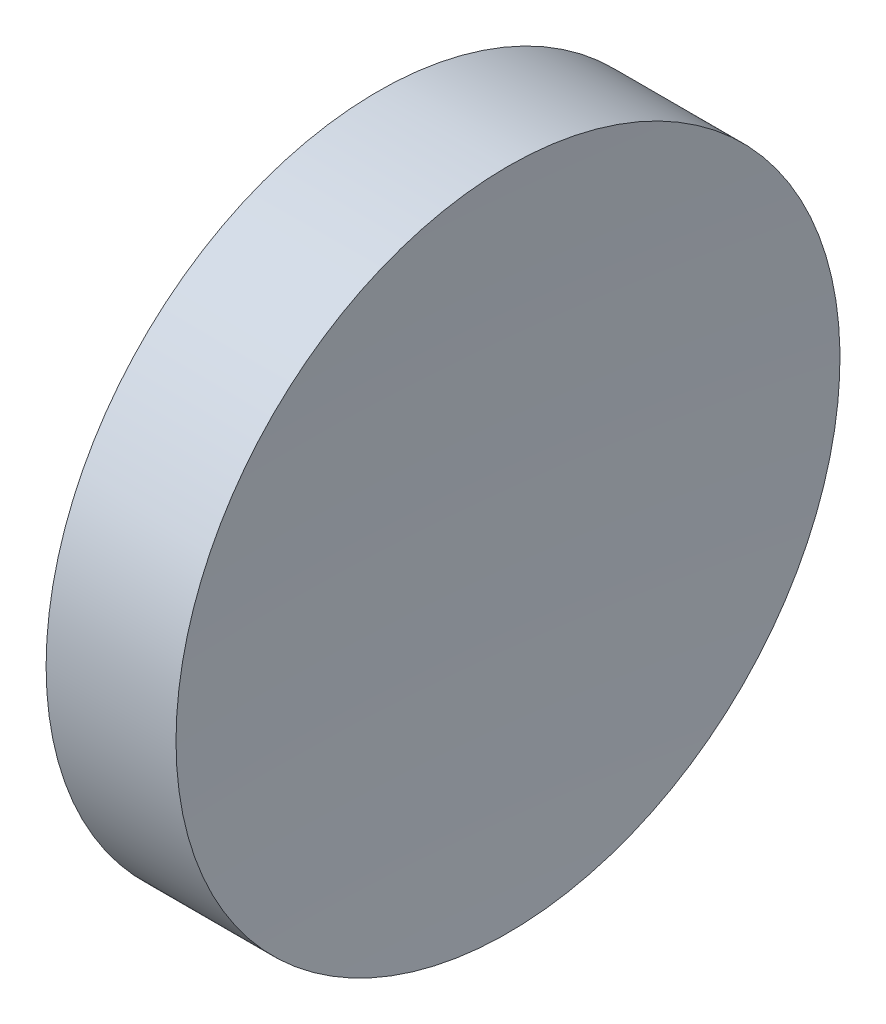
ISO-10303-21;
HEADER;
FILE_DESCRIPTION(('STEP AP214'),'2;1');
FILE_NAME('part.step','',(''),(''),'','','');
FILE_SCHEMA(('AUTOMOTIVE_DESIGN { 1 0 10303 214 1 1 1 1 }'));
ENDSEC;
DATA;
#1=APPLICATION_CONTEXT('core data for automotive mechanical design processes');
#2=APPLICATION_PROTOCOL_DEFINITION('international standard','automotive_design',2000,#1);
#3=PRODUCT_CONTEXT('',#1,'mechanical');
#4=PRODUCT('Part','Part','',(#3));
#5=PRODUCT_RELATED_PRODUCT_CATEGORY('part','',(#4));
#6=PRODUCT_DEFINITION_FORMATION('','',#4);
#7=PRODUCT_DEFINITION_CONTEXT('part definition',#1,'design');
#8=PRODUCT_DEFINITION('design','',#6,#7);
#9=PRODUCT_DEFINITION_SHAPE('','',#8);
#10=(LENGTH_UNIT() NAMED_UNIT(*) SI_UNIT(.MILLI.,.METRE.));
#11=(NAMED_UNIT(*) PLANE_ANGLE_UNIT() SI_UNIT($,.RADIAN.));
#12=(NAMED_UNIT(*) SI_UNIT($,.STERADIAN.) SOLID_ANGLE_UNIT());
#13=UNCERTAINTY_MEASURE_WITH_UNIT(LENGTH_MEASURE(1.E-05),#10,'distance_accuracy_value','');
#14=(GEOMETRIC_REPRESENTATION_CONTEXT(3) GLOBAL_UNCERTAINTY_ASSIGNED_CONTEXT((#13)) GLOBAL_UNIT_ASSIGNED_CONTEXT((#10,
#11,#12)) REPRESENTATION_CONTEXT('',''));
#15=CARTESIAN_POINT('',(0.,0.,0.));
#16=DIRECTION('',(0.,0.,1.));
#17=DIRECTION('',(1.,0.,0.));
#18=AXIS2_PLACEMENT_3D('',#15,#16,#17);
#19=CARTESIAN_POINT('',(639.185311066924,138.756042246744,0.));
#20=DIRECTION('',(-1.,0.,0.));
#21=DIRECTION('',(0.,1.,0.));
#22=AXIS2_PLACEMENT_3D('',#19,#20,#21);
#23=SPHERICAL_SURFACE('',#22,400.);
#24=CARTESIAN_POINT('',(239.967325500141,138.756042246745,0.));
#25=DIRECTION('',(-1.,0.,0.));
#26=DIRECTION('',(0.,0.,1.));
#27=AXIS2_PLACEMENT_3D('',#24,#25,#26);
#28=CIRCLE('',#27,25.);
#29=CARTESIAN_POINT('',(239.967325500141,138.756042246745,25.));
#30=VERTEX_POINT('',#29);
#31=EDGE_CURVE('E10',#30,#30,#28,.T.);
#32=ORIENTED_EDGE('',*,*,#31,.F.);
#33=EDGE_LOOP('',(#32));
#34=FACE_BOUND('',#33,.T.);
#35=ADVANCED_FACE('F35',(#34),#23,.F.);
#36=CARTESIAN_POINT('',(217.97028600433,138.756042246745,0.));
#37=DIRECTION('',(-1.,0.,0.));
#38=DIRECTION('',(0.,0.,1.));
#39=AXIS2_PLACEMENT_3D('',#36,#37,#38);
#40=CYLINDRICAL_SURFACE('',#39,25.);
#41=CARTESIAN_POINT('',(230.185311069839,138.756042246745,0.));
#42=DIRECTION('',(-1.,0.,0.));
#43=DIRECTION('',(0.,0.,1.));
#44=AXIS2_PLACEMENT_3D('',#41,#42,#43);
#45=CIRCLE('',#44,25.);
#46=CARTESIAN_POINT('',(230.185311069839,138.756042246745,25.));
#47=VERTEX_POINT('',#46);
#48=EDGE_CURVE('E41',#47,#47,#45,.T.);
#49=ORIENTED_EDGE('',*,*,#48,.F.);
#50=EDGE_LOOP('',(#49));
#51=FACE_BOUND('',#50,.T.);
#52=ORIENTED_EDGE('',*,*,#31,.T.);
#53=EDGE_LOOP('',(#52));
#54=FACE_BOUND('',#53,.T.);
#55=ADVANCED_FACE('F49',(#51,#54),#40,.T.);
#56=CARTESIAN_POINT('',(230.185311069839,138.756042246745,0.));
#57=DIRECTION('',(1.,0.,0.));
#58=DIRECTION('',(0.,0.,-1.));
#59=AXIS2_PLACEMENT_3D('',#56,#57,#58);
#60=PLANE('',#59);
#61=ORIENTED_EDGE('',*,*,#48,.T.);
#62=EDGE_LOOP('',(#61));
#63=FACE_BOUND('',#62,.T.);
#64=ADVANCED_FACE('F47',(#63),#60,.F.);
#65=CLOSED_SHELL('',(#35,#55,#64));
#66=MANIFOLD_SOLID_BREP('B2',#65);
#67=ADVANCED_BREP_SHAPE_REPRESENTATION('',(#18,#66),#14);
#68=SHAPE_DEFINITION_REPRESENTATION(#9,#67);
ENDSEC;
END-ISO-10303-21;
